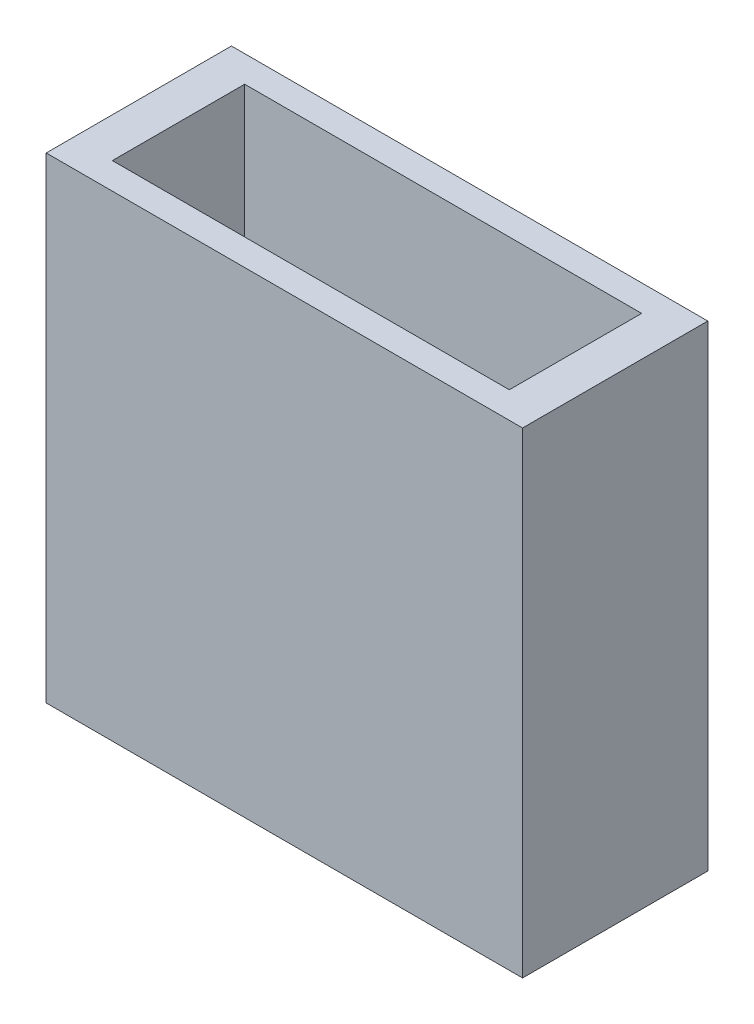
ISO-10303-21;
HEADER;
FILE_DESCRIPTION(('STEP AP214'),'2;1');
FILE_NAME('part.step','',(''),(''),'','','');
FILE_SCHEMA(('AUTOMOTIVE_DESIGN { 1 0 10303 214 1 1 1 1 }'));
ENDSEC;
DATA;
#1=APPLICATION_CONTEXT('core data for automotive mechanical design processes');
#2=APPLICATION_PROTOCOL_DEFINITION('international standard','automotive_design',2000,#1);
#3=PRODUCT_CONTEXT('',#1,'mechanical');
#4=PRODUCT('Part','Part','',(#3));
#5=PRODUCT_RELATED_PRODUCT_CATEGORY('part','',(#4));
#6=PRODUCT_DEFINITION_FORMATION('','',#4);
#7=PRODUCT_DEFINITION_CONTEXT('part definition',#1,'design');
#8=PRODUCT_DEFINITION('design','',#6,#7);
#9=PRODUCT_DEFINITION_SHAPE('','',#8);
#10=(LENGTH_UNIT() NAMED_UNIT(*) SI_UNIT(.MILLI.,.METRE.));
#11=(NAMED_UNIT(*) PLANE_ANGLE_UNIT() SI_UNIT($,.RADIAN.));
#12=(NAMED_UNIT(*) SI_UNIT($,.STERADIAN.) SOLID_ANGLE_UNIT());
#13=UNCERTAINTY_MEASURE_WITH_UNIT(LENGTH_MEASURE(1.E-05),#10,'distance_accuracy_value','');
#14=(GEOMETRIC_REPRESENTATION_CONTEXT(3) GLOBAL_UNCERTAINTY_ASSIGNED_CONTEXT((#13)) GLOBAL_UNIT_ASSIGNED_CONTEXT((#10,
#11,#12)) REPRESENTATION_CONTEXT('',''));
#15=CARTESIAN_POINT('',(0.,0.,0.));
#16=DIRECTION('',(0.,0.,1.));
#17=DIRECTION('',(1.,0.,0.));
#18=AXIS2_PLACEMENT_3D('',#15,#16,#17);
#19=CARTESIAN_POINT('',(0.,45.72,0.));
#20=DIRECTION('',(1.,0.,0.));
#21=DIRECTION('',(0.,0.,-1.));
#22=AXIS2_PLACEMENT_3D('',#19,#20,#21);
#23=PLANE('',#22);
#24=DIRECTION('',(0.,0.,1.));
#25=VECTOR('',#24,1.);
#26=CARTESIAN_POINT('',(0.,0.,0.));
#27=LINE('',#26,#25);
#28=CARTESIAN_POINT('',(0.,0.,-17.78));
#29=VERTEX_POINT('',#28);
#30=CARTESIAN_POINT('',(0.,0.,0.));
#31=VERTEX_POINT('',#30);
#32=EDGE_CURVE('E153',#29,#31,#27,.T.);
#33=ORIENTED_EDGE('',*,*,#32,.T.);
#34=DIRECTION('',(0.,-1.,0.));
#35=VECTOR('',#34,1.);
#36=CARTESIAN_POINT('',(0.,45.72,0.));
#37=LINE('',#36,#35);
#38=CARTESIAN_POINT('',(0.,45.72,0.));
#39=VERTEX_POINT('',#38);
#40=EDGE_CURVE('E11',#39,#31,#37,.T.);
#41=ORIENTED_EDGE('',*,*,#40,.F.);
#42=DIRECTION('',(0.,0.,1.));
#43=VECTOR('',#42,1.);
#44=CARTESIAN_POINT('',(0.,45.72,0.));
#45=LINE('',#44,#43);
#46=CARTESIAN_POINT('',(0.,45.72,-17.78));
#47=VERTEX_POINT('',#46);
#48=EDGE_CURVE('E157',#47,#39,#45,.T.);
#49=ORIENTED_EDGE('',*,*,#48,.F.);
#50=DIRECTION('',(0.,-1.,0.));
#51=VECTOR('',#50,1.);
#52=CARTESIAN_POINT('',(0.,45.72,-17.78));
#53=LINE('',#52,#51);
#54=EDGE_CURVE('E163',#47,#29,#53,.T.);
#55=ORIENTED_EDGE('',*,*,#54,.T.);
#56=EDGE_LOOP('',(#33,#41,#49,#55));
#57=FACE_BOUND('',#56,.T.);
#58=ADVANCED_FACE('F40',(#57),#23,.F.);
#59=CARTESIAN_POINT('',(0.,45.72,0.));
#60=DIRECTION('',(0.,0.,-1.));
#61=DIRECTION('',(-1.,0.,0.));
#62=AXIS2_PLACEMENT_3D('',#59,#60,#61);
#63=PLANE('',#62);
#64=DIRECTION('',(1.,0.,0.));
#65=VECTOR('',#64,1.);
#66=CARTESIAN_POINT('',(0.,0.,0.));
#67=LINE('',#66,#65);
#68=CARTESIAN_POINT('',(45.72,0.,0.));
#69=VERTEX_POINT('',#68);
#70=EDGE_CURVE('E166',#31,#69,#67,.T.);
#71=ORIENTED_EDGE('',*,*,#70,.T.);
#72=DIRECTION('',(0.,-1.,0.));
#73=VECTOR('',#72,1.);
#74=CARTESIAN_POINT('',(45.72,45.72,0.));
#75=LINE('',#74,#73);
#76=CARTESIAN_POINT('',(45.72,45.72,0.));
#77=VERTEX_POINT('',#76);
#78=EDGE_CURVE('E48',#77,#69,#75,.T.);
#79=ORIENTED_EDGE('',*,*,#78,.F.);
#80=DIRECTION('',(1.,0.,0.));
#81=VECTOR('',#80,1.);
#82=CARTESIAN_POINT('',(0.,45.72,0.));
#83=LINE('',#82,#81);
#84=EDGE_CURVE('E93',#39,#77,#83,.T.);
#85=ORIENTED_EDGE('',*,*,#84,.F.);
#86=ORIENTED_EDGE('',*,*,#40,.T.);
#87=EDGE_LOOP('',(#71,#79,#85,#86));
#88=FACE_BOUND('',#87,.T.);
#89=ADVANCED_FACE('F211',(#88),#63,.F.);
#90=CARTESIAN_POINT('',(45.72,45.72,0.));
#91=DIRECTION('',(-1.,0.,0.));
#92=DIRECTION('',(0.,0.,1.));
#93=AXIS2_PLACEMENT_3D('',#90,#91,#92);
#94=PLANE('',#93);
#95=DIRECTION('',(0.,0.,-1.));
#96=VECTOR('',#95,1.);
#97=CARTESIAN_POINT('',(45.72,0.,0.));
#98=LINE('',#97,#96);
#99=CARTESIAN_POINT('',(45.72,0.,-17.78));
#100=VERTEX_POINT('',#99);
#101=EDGE_CURVE('E168',#69,#100,#98,.T.);
#102=ORIENTED_EDGE('',*,*,#101,.T.);
#103=DIRECTION('',(0.,-1.,0.));
#104=VECTOR('',#103,1.);
#105=CARTESIAN_POINT('',(45.72,45.72,-17.78));
#106=LINE('',#105,#104);
#107=CARTESIAN_POINT('',(45.72,45.72,-17.78));
#108=VERTEX_POINT('',#107);
#109=EDGE_CURVE('E172',#108,#100,#106,.T.);
#110=ORIENTED_EDGE('',*,*,#109,.F.);
#111=DIRECTION('',(0.,0.,-1.));
#112=VECTOR('',#111,1.);
#113=CARTESIAN_POINT('',(45.72,45.72,0.));
#114=LINE('',#113,#112);
#115=EDGE_CURVE('E160',#77,#108,#114,.T.);
#116=ORIENTED_EDGE('',*,*,#115,.F.);
#117=ORIENTED_EDGE('',*,*,#78,.T.);
#118=EDGE_LOOP('',(#102,#110,#116,#117));
#119=FACE_BOUND('',#118,.T.);
#120=ADVANCED_FACE('F216',(#119),#94,.F.);
#121=CARTESIAN_POINT('',(0.,45.72,-17.78));
#122=DIRECTION('',(0.,0.,1.));
#123=DIRECTION('',(1.,0.,0.));
#124=AXIS2_PLACEMENT_3D('',#121,#122,#123);
#125=PLANE('',#124);
#126=DIRECTION('',(-1.,0.,0.));
#127=VECTOR('',#126,1.);
#128=CARTESIAN_POINT('',(0.,0.,-17.78));
#129=LINE('',#128,#127);
#130=EDGE_CURVE('E86',#100,#29,#129,.T.);
#131=ORIENTED_EDGE('',*,*,#130,.T.);
#132=ORIENTED_EDGE('',*,*,#54,.F.);
#133=DIRECTION('',(-1.,0.,0.));
#134=VECTOR('',#133,1.);
#135=CARTESIAN_POINT('',(0.,45.72,-17.78));
#136=LINE('',#135,#134);
#137=EDGE_CURVE('E65',#108,#47,#136,.T.);
#138=ORIENTED_EDGE('',*,*,#137,.F.);
#139=ORIENTED_EDGE('',*,*,#109,.T.);
#140=EDGE_LOOP('',(#131,#132,#138,#139));
#141=FACE_BOUND('',#140,.T.);
#142=ADVANCED_FACE('F226',(#141),#125,.F.);
#143=CARTESIAN_POINT('',(0.,45.72,0.));
#144=DIRECTION('',(0.,-1.,0.));
#145=DIRECTION('',(0.,0.,-1.));
#146=AXIS2_PLACEMENT_3D('',#143,#144,#145);
#147=PLANE('',#146);
#148=DIRECTION('',(1.,0.,0.));
#149=VECTOR('',#148,1.);
#150=CARTESIAN_POINT('',(3.81,45.72,-2.54));
#151=LINE('',#150,#149);
#152=CARTESIAN_POINT('',(3.81,45.72,-2.54));
#153=VERTEX_POINT('',#152);
#154=CARTESIAN_POINT('',(41.91,45.72,-2.54));
#155=VERTEX_POINT('',#154);
#156=EDGE_CURVE('E147',#153,#155,#151,.T.);
#157=ORIENTED_EDGE('',*,*,#156,.F.);
#158=DIRECTION('',(0.,0.,1.));
#159=VECTOR('',#158,1.);
#160=CARTESIAN_POINT('',(3.81,45.72,-2.54));
#161=LINE('',#160,#159);
#162=CARTESIAN_POINT('',(3.81,45.72,-15.24));
#163=VERTEX_POINT('',#162);
#164=EDGE_CURVE('E56',#163,#153,#161,.T.);
#165=ORIENTED_EDGE('',*,*,#164,.F.);
#166=DIRECTION('',(-1.,0.,0.));
#167=VECTOR('',#166,1.);
#168=CARTESIAN_POINT('',(3.81,45.72,-15.24));
#169=LINE('',#168,#167);
#170=CARTESIAN_POINT('',(41.91,45.72,-15.24));
#171=VERTEX_POINT('',#170);
#172=EDGE_CURVE('E135',#171,#163,#169,.T.);
#173=ORIENTED_EDGE('',*,*,#172,.F.);
#174=DIRECTION('',(0.,0.,-1.));
#175=VECTOR('',#174,1.);
#176=CARTESIAN_POINT('',(41.91,45.72,-2.54));
#177=LINE('',#176,#175);
#178=EDGE_CURVE('E138',#155,#171,#177,.T.);
#179=ORIENTED_EDGE('',*,*,#178,.F.);
#180=EDGE_LOOP('',(#157,#165,#173,#179));
#181=FACE_BOUND('',#180,.T.);
#182=ORIENTED_EDGE('',*,*,#48,.T.);
#183=ORIENTED_EDGE('',*,*,#84,.T.);
#184=ORIENTED_EDGE('',*,*,#115,.T.);
#185=ORIENTED_EDGE('',*,*,#137,.T.);
#186=EDGE_LOOP('',(#182,#183,#184,#185));
#187=FACE_BOUND('',#186,.T.);
#188=ADVANCED_FACE('F224',(#181,#187),#147,.F.);
#189=CARTESIAN_POINT('',(0.,0.,0.));
#190=DIRECTION('',(0.,-1.,0.));
#191=DIRECTION('',(0.,0.,-1.));
#192=AXIS2_PLACEMENT_3D('',#189,#190,#191);
#193=PLANE('',#192);
#194=CARTESIAN_POINT('',(29.7037039670805,0.,-8.88617054379551));
#195=DIRECTION('',(0.,-1.,0.));
#196=DIRECTION('',(0.987688340595138,0.,0.156434465040228));
#197=AXIS2_PLACEMENT_3D('',#194,#195,#196);
#198=ELLIPSE('',#197,3.10119923025933,3.04800000000001);
#199=CARTESIAN_POINT('',(32.7667222886703,0.,-8.40103610122672));
#200=VERTEX_POINT('',#199);
#201=EDGE_CURVE('E141',#200,#200,#198,.F.);
#202=ORIENTED_EDGE('',*,*,#201,.T.);
#203=EDGE_LOOP('',(#202));
#204=FACE_BOUND('',#203,.T.);
#205=CARTESIAN_POINT('',(15.2376722800284,0.,-8.88617054379551));
#206=DIRECTION('',(0.,-1.,0.));
#207=DIRECTION('',(0.987688340595138,0.,0.156434465040228));
#208=AXIS2_PLACEMENT_3D('',#205,#206,#207);
#209=ELLIPSE('',#208,3.10119923025932,3.048);
#210=CARTESIAN_POINT('',(18.3006906016182,0.,-8.40103610122672));
#211=VERTEX_POINT('',#210);
#212=EDGE_CURVE('E181',#211,#211,#209,.F.);
#213=ORIENTED_EDGE('',*,*,#212,.T.);
#214=EDGE_LOOP('',(#213));
#215=FACE_BOUND('',#214,.T.);
#216=CARTESIAN_POINT('',(22.4706881235545,0.,-8.88617054379551));
#217=DIRECTION('',(0.,-1.,0.));
#218=DIRECTION('',(0.987688340595138,0.,0.156434465040228));
#219=AXIS2_PLACEMENT_3D('',#216,#217,#218);
#220=ELLIPSE('',#219,3.10119923025932,3.048);
#221=CARTESIAN_POINT('',(25.5337064451442,0.,-8.40103610122672));
#222=VERTEX_POINT('',#221);
#223=EDGE_CURVE('E178',#222,#222,#220,.F.);
#224=ORIENTED_EDGE('',*,*,#223,.T.);
#225=EDGE_LOOP('',(#224));
#226=FACE_BOUND('',#225,.T.);
#227=ORIENTED_EDGE('',*,*,#32,.F.);
#228=ORIENTED_EDGE('',*,*,#130,.F.);
#229=ORIENTED_EDGE('',*,*,#101,.F.);
#230=ORIENTED_EDGE('',*,*,#70,.F.);
#231=EDGE_LOOP('',(#227,#228,#229,#230));
#232=FACE_BOUND('',#231,.T.);
#233=ADVANCED_FACE('F189',(#204,#215,#226,#232),#193,.T.);
#234=CARTESIAN_POINT('',(3.81,3.81,-2.54));
#235=DIRECTION('',(-1.,0.,0.));
#236=DIRECTION('',(0.,0.,1.));
#237=AXIS2_PLACEMENT_3D('',#234,#235,#236);
#238=PLANE('',#237);
#239=ORIENTED_EDGE('',*,*,#164,.T.);
#240=DIRECTION('',(0.,1.,0.));
#241=VECTOR('',#240,1.);
#242=CARTESIAN_POINT('',(3.81,3.81,-2.54));
#243=LINE('',#242,#241);
#244=CARTESIAN_POINT('',(3.81,3.81,-2.54));
#245=VERTEX_POINT('',#244);
#246=EDGE_CURVE('E113',#245,#153,#243,.T.);
#247=ORIENTED_EDGE('',*,*,#246,.F.);
#248=DIRECTION('',(0.,0.,1.));
#249=VECTOR('',#248,1.);
#250=CARTESIAN_POINT('',(3.81,3.81,-2.54));
#251=LINE('',#250,#249);
#252=CARTESIAN_POINT('',(3.81,3.81,-15.24));
#253=VERTEX_POINT('',#252);
#254=EDGE_CURVE('E117',#253,#245,#251,.T.);
#255=ORIENTED_EDGE('',*,*,#254,.F.);
#256=DIRECTION('',(0.,1.,0.));
#257=VECTOR('',#256,1.);
#258=CARTESIAN_POINT('',(3.81,3.81,-15.24));
#259=LINE('',#258,#257);
#260=EDGE_CURVE('E151',#253,#163,#259,.T.);
#261=ORIENTED_EDGE('',*,*,#260,.T.);
#262=EDGE_LOOP('',(#239,#247,#255,#261));
#263=FACE_BOUND('',#262,.T.);
#264=ADVANCED_FACE('F115',(#263),#238,.F.);
#265=CARTESIAN_POINT('',(3.81,3.81,-15.24));
#266=DIRECTION('',(0.,0.,-1.));
#267=DIRECTION('',(-1.,0.,0.));
#268=AXIS2_PLACEMENT_3D('',#265,#266,#267);
#269=PLANE('',#268);
#270=ORIENTED_EDGE('',*,*,#172,.T.);
#271=ORIENTED_EDGE('',*,*,#260,.F.);
#272=DIRECTION('',(-1.,0.,0.));
#273=VECTOR('',#272,1.);
#274=CARTESIAN_POINT('',(3.81,3.81,-15.24));
#275=LINE('',#274,#273);
#276=CARTESIAN_POINT('',(41.91,3.81,-15.24));
#277=VERTEX_POINT('',#276);
#278=EDGE_CURVE('E123',#277,#253,#275,.T.);
#279=ORIENTED_EDGE('',*,*,#278,.F.);
#280=DIRECTION('',(0.,1.,0.));
#281=VECTOR('',#280,1.);
#282=CARTESIAN_POINT('',(41.91,3.81,-15.24));
#283=LINE('',#282,#281);
#284=EDGE_CURVE('E154',#277,#171,#283,.T.);
#285=ORIENTED_EDGE('',*,*,#284,.T.);
#286=EDGE_LOOP('',(#270,#271,#279,#285));
#287=FACE_BOUND('',#286,.T.);
#288=ADVANCED_FACE('F267',(#287),#269,.F.);
#289=CARTESIAN_POINT('',(41.91,3.81,-2.54));
#290=DIRECTION('',(1.,0.,0.));
#291=DIRECTION('',(0.,0.,-1.));
#292=AXIS2_PLACEMENT_3D('',#289,#290,#291);
#293=PLANE('',#292);
#294=ORIENTED_EDGE('',*,*,#178,.T.);
#295=ORIENTED_EDGE('',*,*,#284,.F.);
#296=DIRECTION('',(0.,0.,-1.));
#297=VECTOR('',#296,1.);
#298=CARTESIAN_POINT('',(41.91,3.81,-2.54));
#299=LINE('',#298,#297);
#300=CARTESIAN_POINT('',(41.91,3.81,-2.54));
#301=VERTEX_POINT('',#300);
#302=EDGE_CURVE('E131',#301,#277,#299,.T.);
#303=ORIENTED_EDGE('',*,*,#302,.F.);
#304=DIRECTION('',(0.,1.,0.));
#305=VECTOR('',#304,1.);
#306=CARTESIAN_POINT('',(41.91,3.81,-2.54));
#307=LINE('',#306,#305);
#308=EDGE_CURVE('E122',#301,#155,#307,.T.);
#309=ORIENTED_EDGE('',*,*,#308,.T.);
#310=EDGE_LOOP('',(#294,#295,#303,#309));
#311=FACE_BOUND('',#310,.T.);
#312=ADVANCED_FACE('F205',(#311),#293,.F.);
#313=CARTESIAN_POINT('',(3.81,3.81,-2.54));
#314=DIRECTION('',(0.,0.,1.));
#315=DIRECTION('',(1.,0.,0.));
#316=AXIS2_PLACEMENT_3D('',#313,#314,#315);
#317=PLANE('',#316);
#318=ORIENTED_EDGE('',*,*,#156,.T.);
#319=ORIENTED_EDGE('',*,*,#308,.F.);
#320=DIRECTION('',(1.,0.,0.));
#321=VECTOR('',#320,1.);
#322=CARTESIAN_POINT('',(3.81,3.81,-2.54));
#323=LINE('',#322,#321);
#324=EDGE_CURVE('E126',#245,#301,#323,.T.);
#325=ORIENTED_EDGE('',*,*,#324,.F.);
#326=ORIENTED_EDGE('',*,*,#246,.T.);
#327=EDGE_LOOP('',(#318,#319,#325,#326));
#328=FACE_BOUND('',#327,.T.);
#329=ADVANCED_FACE('F127',(#328),#317,.F.);
#330=CARTESIAN_POINT('',(0.,3.81,0.));
#331=DIRECTION('',(0.,-1.,0.));
#332=DIRECTION('',(0.,0.,-1.));
#333=AXIS2_PLACEMENT_3D('',#330,#331,#332);
#334=PLANE('',#333);
#335=CARTESIAN_POINT('',(30.4098457282697,3.81,-8.77432867615979));
#336=DIRECTION('',(0.,-1.,0.));
#337=DIRECTION('',(0.987688340595138,0.,0.156434465040228));
#338=AXIS2_PLACEMENT_3D('',#335,#336,#337);
#339=ELLIPSE('',#338,3.10119923025933,3.04800000000001);
#340=CARTESIAN_POINT('',(33.4728640498594,3.81,-8.289194233591));
#341=VERTEX_POINT('',#340);
#342=EDGE_CURVE('E43',#341,#341,#339,.F.);
#343=ORIENTED_EDGE('',*,*,#342,.F.);
#344=EDGE_LOOP('',(#343));
#345=FACE_BOUND('',#344,.T.);
#346=CARTESIAN_POINT('',(15.9438140412176,3.81,-8.77432867615978));
#347=DIRECTION('',(0.,-1.,0.));
#348=DIRECTION('',(0.987688340595138,0.,0.156434465040228));
#349=AXIS2_PLACEMENT_3D('',#346,#347,#348);
#350=ELLIPSE('',#349,3.10119923025932,3.048);
#351=CARTESIAN_POINT('',(19.0068323628073,3.81,-8.289194233591));
#352=VERTEX_POINT('',#351);
#353=EDGE_CURVE('E179',#352,#352,#350,.F.);
#354=ORIENTED_EDGE('',*,*,#353,.F.);
#355=EDGE_LOOP('',(#354));
#356=FACE_BOUND('',#355,.T.);
#357=CARTESIAN_POINT('',(23.1768298847436,3.81,-8.77432867615978));
#358=DIRECTION('',(0.,-1.,0.));
#359=DIRECTION('',(0.987688340595138,0.,0.156434465040228));
#360=AXIS2_PLACEMENT_3D('',#357,#358,#359);
#361=ELLIPSE('',#360,3.10119923025932,3.048);
#362=CARTESIAN_POINT('',(26.2398482063334,3.81,-8.289194233591));
#363=VERTEX_POINT('',#362);
#364=EDGE_CURVE('E176',#363,#363,#361,.F.);
#365=ORIENTED_EDGE('',*,*,#364,.F.);
#366=EDGE_LOOP('',(#365));
#367=FACE_BOUND('',#366,.T.);
#368=ORIENTED_EDGE('',*,*,#254,.T.);
#369=ORIENTED_EDGE('',*,*,#324,.T.);
#370=ORIENTED_EDGE('',*,*,#302,.T.);
#371=ORIENTED_EDGE('',*,*,#278,.T.);
#372=EDGE_LOOP('',(#368,#369,#370,#371));
#373=FACE_BOUND('',#372,.T.);
#374=ADVANCED_FACE('F133',(#345,#356,#367,#373),#334,.F.);
#375=CARTESIAN_POINT('',(21.6783207014487,-4.27523203434248,-9.01166921447712));
#376=DIRECTION('',(0.182159663732433,0.982845594136539,0.0288512563899666));
#377=DIRECTION('',(-0.983254907563954,0.182235525492148,0.));
#378=AXIS2_PLACEMENT_3D('',#375,#376,#377);
#379=CYLINDRICAL_SURFACE('',#378,3.048);
#380=ORIENTED_EDGE('',*,*,#223,.F.);
#381=EDGE_LOOP('',(#380));
#382=FACE_BOUND('',#381,.T.);
#383=ORIENTED_EDGE('',*,*,#364,.T.);
#384=EDGE_LOOP('',(#383));
#385=FACE_BOUND('',#384,.T.);
#386=ADVANCED_FACE('F192',(#382,#385),#379,.F.);
#387=CARTESIAN_POINT('',(14.6853118246228,-2.98027032355548,-8.97365584538232));
#388=DIRECTION('',(0.182159663732433,0.982845594136539,0.0288512563899666));
#389=DIRECTION('',(-0.983254907563954,0.182235525492148,0.));
#390=AXIS2_PLACEMENT_3D('',#387,#388,#389);
#391=CYLINDRICAL_SURFACE('',#390,3.048);
#392=ORIENTED_EDGE('',*,*,#212,.F.);
#393=EDGE_LOOP('',(#392));
#394=FACE_BOUND('',#393,.T.);
#395=ORIENTED_EDGE('',*,*,#353,.T.);
#396=EDGE_LOOP('',(#395));
#397=FACE_BOUND('',#396,.T.);
#398=ADVANCED_FACE('F195',(#394,#397),#391,.F.);
#399=CARTESIAN_POINT('',(28.6713295782746,-5.57019374512948,-9.04968258357192));
#400=DIRECTION('',(0.182159663732433,0.982845594136539,0.0288512563899666));
#401=DIRECTION('',(-0.983254907563954,0.182235525492148,0.));
#402=AXIS2_PLACEMENT_3D('',#399,#400,#401);
#403=CYLINDRICAL_SURFACE('',#402,3.04800000000001);
#404=ORIENTED_EDGE('',*,*,#201,.F.);
#405=EDGE_LOOP('',(#404));
#406=FACE_BOUND('',#405,.T.);
#407=ORIENTED_EDGE('',*,*,#342,.T.);
#408=EDGE_LOOP('',(#407));
#409=FACE_BOUND('',#408,.T.);
#410=ADVANCED_FACE('F311',(#406,#409),#403,.F.);
#411=CLOSED_SHELL('',(#58,#89,#120,#142,#188,#233,#264,#288,#312,#329,#374,#386,#398,#410));
#412=MANIFOLD_SOLID_BREP('B2',#411);
#413=ADVANCED_BREP_SHAPE_REPRESENTATION('',(#18,#412),#14);
#414=SHAPE_DEFINITION_REPRESENTATION(#9,#413);
ENDSEC;
END-ISO-10303-21;
